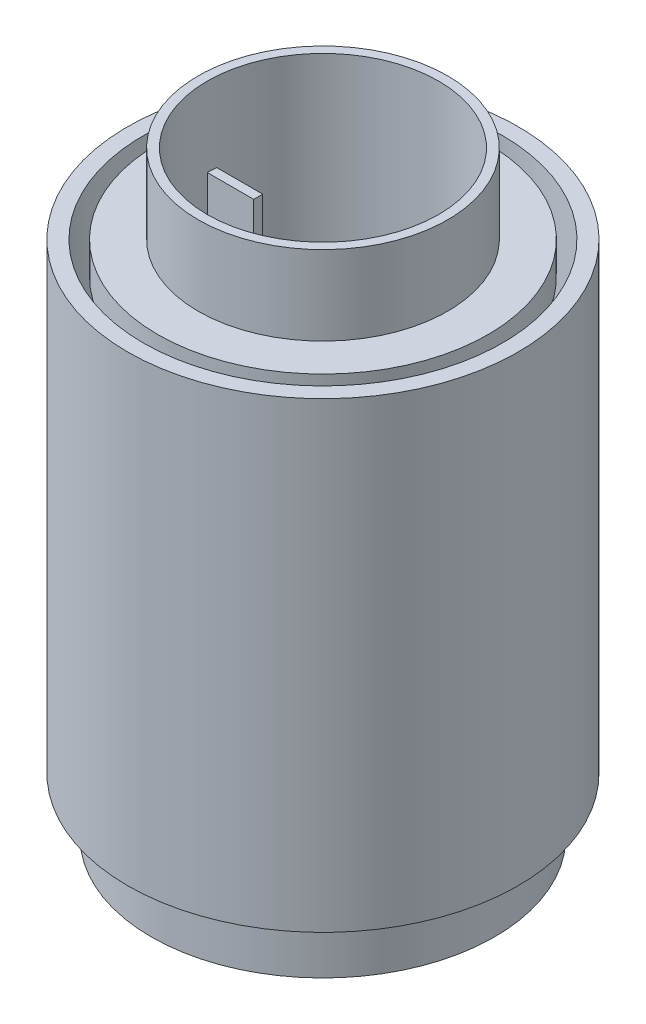
ISO-10303-21;
HEADER;
FILE_DESCRIPTION(('STEP AP214'),'2;1');
FILE_NAME('part.step','',(''),(''),'','','');
FILE_SCHEMA(('AUTOMOTIVE_DESIGN { 1 0 10303 214 1 1 1 1 }'));
ENDSEC;
DATA;
#1=APPLICATION_CONTEXT('core data for automotive mechanical design processes');
#2=APPLICATION_PROTOCOL_DEFINITION('international standard','automotive_design',2000,#1);
#3=PRODUCT_CONTEXT('',#1,'mechanical');
#4=PRODUCT('Part','Part','',(#3));
#5=PRODUCT_RELATED_PRODUCT_CATEGORY('part','',(#4));
#6=PRODUCT_DEFINITION_FORMATION('','',#4);
#7=PRODUCT_DEFINITION_CONTEXT('part definition',#1,'design');
#8=PRODUCT_DEFINITION('design','',#6,#7);
#9=PRODUCT_DEFINITION_SHAPE('','',#8);
#10=(LENGTH_UNIT() NAMED_UNIT(*) SI_UNIT(.MILLI.,.METRE.));
#11=(NAMED_UNIT(*) PLANE_ANGLE_UNIT() SI_UNIT($,.RADIAN.));
#12=(NAMED_UNIT(*) SI_UNIT($,.STERADIAN.) SOLID_ANGLE_UNIT());
#13=UNCERTAINTY_MEASURE_WITH_UNIT(LENGTH_MEASURE(1.E-05),#10,'distance_accuracy_value','');
#14=(GEOMETRIC_REPRESENTATION_CONTEXT(3) GLOBAL_UNCERTAINTY_ASSIGNED_CONTEXT((#13)) GLOBAL_UNIT_ASSIGNED_CONTEXT((#10,
#11,#12)) REPRESENTATION_CONTEXT('',''));
#15=CARTESIAN_POINT('',(0.,0.,0.));
#16=DIRECTION('',(0.,0.,1.));
#17=DIRECTION('',(1.,0.,0.));
#18=AXIS2_PLACEMENT_3D('',#15,#16,#17);
#19=CARTESIAN_POINT('',(0.,5.,0.));
#20=DIRECTION('',(0.,1.,0.));
#21=DIRECTION('',(0.,0.,1.));
#22=AXIS2_PLACEMENT_3D('',#19,#20,#21);
#23=PLANE('',#22);
#24=CARTESIAN_POINT('',(0.,5.,0.));
#25=DIRECTION('',(0.,1.,0.));
#26=DIRECTION('',(0.,0.,1.));
#27=AXIS2_PLACEMENT_3D('',#24,#25,#26);
#28=CIRCLE('',#27,29.5667950972865);
#29=CARTESIAN_POINT('',(0.,5.,29.5667950972865));
#30=VERTEX_POINT('',#29);
#31=EDGE_CURVE('E11',#30,#30,#28,.T.);
#32=ORIENTED_EDGE('',*,*,#31,.T.);
#33=EDGE_LOOP('',(#32));
#34=FACE_BOUND('',#33,.T.);
#35=CARTESIAN_POINT('',(0.,5.,0.));
#36=DIRECTION('',(0.,1.,0.));
#37=DIRECTION('',(0.,0.,1.));
#38=AXIS2_PLACEMENT_3D('',#35,#36,#37);
#39=CIRCLE('',#38,27.2032127719219);
#40=CARTESIAN_POINT('',(0.,5.,27.2032127719219));
#41=VERTEX_POINT('',#40);
#42=EDGE_CURVE('E57',#41,#41,#39,.T.);
#43=ORIENTED_EDGE('',*,*,#42,.F.);
#44=EDGE_LOOP('',(#43));
#45=FACE_BOUND('',#44,.T.);
#46=ADVANCED_FACE('F46',(#34,#45),#23,.T.);
#47=CARTESIAN_POINT('',(0.,-65.,0.));
#48=DIRECTION('',(0.,1.,0.));
#49=DIRECTION('',(0.,0.,1.));
#50=AXIS2_PLACEMENT_3D('',#47,#48,#49);
#51=PLANE('',#50);
#52=CARTESIAN_POINT('',(0.,-65.,0.));
#53=DIRECTION('',(0.,1.,0.));
#54=DIRECTION('',(0.,0.,1.));
#55=AXIS2_PLACEMENT_3D('',#52,#53,#54);
#56=CIRCLE('',#55,29.5667950972865);
#57=CARTESIAN_POINT('',(0.,-65.,29.5667950972865));
#58=VERTEX_POINT('',#57);
#59=EDGE_CURVE('E50',#58,#58,#56,.T.);
#60=ORIENTED_EDGE('',*,*,#59,.F.);
#61=EDGE_LOOP('',(#60));
#62=FACE_BOUND('',#61,.T.);
#63=CARTESIAN_POINT('',(0.,-65.,0.));
#64=DIRECTION('',(0.,1.,0.));
#65=DIRECTION('',(0.,0.,1.));
#66=AXIS2_PLACEMENT_3D('',#63,#64,#65);
#67=CIRCLE('',#66,27.2032127719219);
#68=CARTESIAN_POINT('',(0.,-65.,27.2032127719219));
#69=VERTEX_POINT('',#68);
#70=EDGE_CURVE('E59',#69,#69,#67,.T.);
#71=ORIENTED_EDGE('',*,*,#70,.T.);
#72=EDGE_LOOP('',(#71));
#73=FACE_BOUND('',#72,.T.);
#74=ADVANCED_FACE('F69',(#62,#73),#51,.F.);
#75=CARTESIAN_POINT('',(0.,5.,0.));
#76=DIRECTION('',(0.,-1.,0.));
#77=DIRECTION('',(0.,0.,-1.));
#78=AXIS2_PLACEMENT_3D('',#75,#76,#77);
#79=CYLINDRICAL_SURFACE('',#78,29.5667950972865);
#80=ORIENTED_EDGE('',*,*,#31,.F.);
#81=EDGE_LOOP('',(#80));
#82=FACE_BOUND('',#81,.T.);
#83=ORIENTED_EDGE('',*,*,#59,.T.);
#84=EDGE_LOOP('',(#83));
#85=FACE_BOUND('',#84,.T.);
#86=ADVANCED_FACE('F48',(#82,#85),#79,.T.);
#87=CARTESIAN_POINT('',(0.,5.,0.));
#88=DIRECTION('',(0.,-1.,0.));
#89=DIRECTION('',(0.,0.,-1.));
#90=AXIS2_PLACEMENT_3D('',#87,#88,#89);
#91=CYLINDRICAL_SURFACE('',#90,27.2032127719219);
#92=ORIENTED_EDGE('',*,*,#42,.T.);
#93=EDGE_LOOP('',(#92));
#94=FACE_BOUND('',#93,.T.);
#95=ORIENTED_EDGE('',*,*,#70,.F.);
#96=EDGE_LOOP('',(#95));
#97=FACE_BOUND('',#96,.T.);
#98=ADVANCED_FACE('F65',(#94,#97),#91,.F.);
#99=CLOSED_SHELL('',(#46,#74,#86,#98));
#100=MANIFOLD_SOLID_BREP('B2',#99);
#101=CARTESIAN_POINT('',(-17.4650572607484,5.,-1.36041410686601));
#102=DIRECTION('',(0.99924472436709,0.,0.0388584717216141));
#103=DIRECTION('',(0.0388584717216141,0.,-0.99924472436709));
#104=AXIS2_PLACEMENT_3D('',#101,#102,#103);
#105=PLANE('',#104);
#106=DIRECTION('',(-0.0388584717216141,0.,0.999244724367089));
#107=VECTOR('',#106,1.);
#108=CARTESIAN_POINT('',(-17.4650572607484,-65.,-1.36041410686601));
#109=LINE('',#108,#107);
#110=CARTESIAN_POINT('',(-17.4650572607484,-65.,-1.36041410686601));
#111=VERTEX_POINT('',#110);
#112=CARTESIAN_POINT('',(-17.5179608306269,-65.,0.));
#113=VERTEX_POINT('',#112);
#114=EDGE_CURVE('E181',#111,#113,#109,.T.);
#115=ORIENTED_EDGE('',*,*,#114,.T.);
#116=DIRECTION('',(0.,-1.,0.));
#117=VECTOR('',#116,1.);
#118=CARTESIAN_POINT('',(-17.5179608306269,5.,0.));
#119=LINE('',#118,#117);
#120=CARTESIAN_POINT('',(-17.5179608306269,5.,0.));
#121=VERTEX_POINT('',#120);
#122=EDGE_CURVE('E44',#121,#113,#119,.T.);
#123=ORIENTED_EDGE('',*,*,#122,.F.);
#124=DIRECTION('',(-0.0388584717216141,0.,0.999244724367089));
#125=VECTOR('',#124,1.);
#126=CARTESIAN_POINT('',(-17.4650572607484,5.,-1.36041410686601));
#127=LINE('',#126,#125);
#128=CARTESIAN_POINT('',(-17.4650572607484,5.,-1.36041410686601));
#129=VERTEX_POINT('',#128);
#130=EDGE_CURVE('E169',#129,#121,#127,.T.);
#131=ORIENTED_EDGE('',*,*,#130,.F.);
#132=DIRECTION('',(0.,-1.,0.));
#133=VECTOR('',#132,1.);
#134=CARTESIAN_POINT('',(-17.4650572607484,5.,-1.36041410686601));
#135=LINE('',#134,#133);
#136=EDGE_CURVE('E177',#129,#111,#135,.T.);
#137=ORIENTED_EDGE('',*,*,#136,.T.);
#138=EDGE_LOOP('',(#115,#123,#131,#137));
#139=FACE_BOUND('',#138,.T.);
#140=ADVANCED_FACE('F118',(#139),#105,.F.);
#141=CARTESIAN_POINT('',(-17.5179608306269,5.,0.));
#142=DIRECTION('',(0.,0.,-1.));
#143=DIRECTION('',(-1.,0.,0.));
#144=AXIS2_PLACEMENT_3D('',#141,#142,#143);
#145=PLANE('',#144);
#146=DIRECTION('',(1.,0.,0.));
#147=VECTOR('',#146,1.);
#148=CARTESIAN_POINT('',(-17.5179608306269,-65.,0.));
#149=LINE('',#148,#147);
#150=CARTESIAN_POINT('',(-10.4840818171956,-65.,0.));
#151=VERTEX_POINT('',#150);
#152=EDGE_CURVE('E173',#113,#151,#149,.T.);
#153=ORIENTED_EDGE('',*,*,#152,.T.);
#154=DIRECTION('',(0.,-1.,0.));
#155=VECTOR('',#154,1.);
#156=CARTESIAN_POINT('',(-10.4840818171956,5.,0.));
#157=LINE('',#156,#155);
#158=CARTESIAN_POINT('',(-10.4840818171956,5.,0.));
#159=VERTEX_POINT('',#158);
#160=EDGE_CURVE('E126',#159,#151,#157,.T.);
#161=ORIENTED_EDGE('',*,*,#160,.F.);
#162=DIRECTION('',(1.,0.,0.));
#163=VECTOR('',#162,1.);
#164=CARTESIAN_POINT('',(-17.5179608306269,5.,0.));
#165=LINE('',#164,#163);
#166=EDGE_CURVE('E164',#121,#159,#165,.T.);
#167=ORIENTED_EDGE('',*,*,#166,.F.);
#168=ORIENTED_EDGE('',*,*,#122,.T.);
#169=EDGE_LOOP('',(#153,#161,#167,#168));
#170=FACE_BOUND('',#169,.T.);
#171=ADVANCED_FACE('F172',(#170),#145,.F.);
#172=CARTESIAN_POINT('',(-10.4840818171956,5.,0.));
#173=DIRECTION('',(-1.,0.,0.));
#174=DIRECTION('',(0.,0.,1.));
#175=AXIS2_PLACEMENT_3D('',#172,#173,#174);
#176=PLANE('',#175);
#177=DIRECTION('',(0.,0.,-1.));
#178=VECTOR('',#177,1.);
#179=CARTESIAN_POINT('',(-10.4840818171956,-65.,0.));
#180=LINE('',#179,#178);
#181=CARTESIAN_POINT('',(-10.4840818171956,-65.,-1.36041410686601));
#182=VERTEX_POINT('',#181);
#183=EDGE_CURVE('E151',#151,#182,#180,.T.);
#184=ORIENTED_EDGE('',*,*,#183,.T.);
#185=DIRECTION('',(0.,-1.,0.));
#186=VECTOR('',#185,1.);
#187=CARTESIAN_POINT('',(-10.4840818171956,5.,-1.36041410686601));
#188=LINE('',#187,#186);
#189=CARTESIAN_POINT('',(-10.4840818171956,5.,-1.36041410686601));
#190=VERTEX_POINT('',#189);
#191=EDGE_CURVE('E174',#190,#182,#188,.T.);
#192=ORIENTED_EDGE('',*,*,#191,.F.);
#193=DIRECTION('',(0.,0.,-1.));
#194=VECTOR('',#193,1.);
#195=CARTESIAN_POINT('',(-10.4840818171956,5.,0.));
#196=LINE('',#195,#194);
#197=EDGE_CURVE('E167',#159,#190,#196,.T.);
#198=ORIENTED_EDGE('',*,*,#197,.F.);
#199=ORIENTED_EDGE('',*,*,#160,.T.);
#200=EDGE_LOOP('',(#184,#192,#198,#199));
#201=FACE_BOUND('',#200,.T.);
#202=ADVANCED_FACE('F175',(#201),#176,.F.);
#203=CARTESIAN_POINT('',(-10.4840818171956,5.,-1.36041410686601));
#204=DIRECTION('',(0.,0.,1.));
#205=DIRECTION('',(1.,0.,0.));
#206=AXIS2_PLACEMENT_3D('',#203,#204,#205);
#207=PLANE('',#206);
#208=DIRECTION('',(-1.,0.,0.));
#209=VECTOR('',#208,1.);
#210=CARTESIAN_POINT('',(-10.4840818171956,-65.,-1.36041410686601));
#211=LINE('',#210,#209);
#212=EDGE_CURVE('E157',#182,#111,#211,.T.);
#213=ORIENTED_EDGE('',*,*,#212,.T.);
#214=ORIENTED_EDGE('',*,*,#136,.F.);
#215=DIRECTION('',(-1.,0.,0.));
#216=VECTOR('',#215,1.);
#217=CARTESIAN_POINT('',(-10.4840818171956,5.,-1.36041410686601));
#218=LINE('',#217,#216);
#219=EDGE_CURVE('E134',#190,#129,#218,.T.);
#220=ORIENTED_EDGE('',*,*,#219,.F.);
#221=ORIENTED_EDGE('',*,*,#191,.T.);
#222=EDGE_LOOP('',(#213,#214,#220,#221));
#223=FACE_BOUND('',#222,.T.);
#224=ADVANCED_FACE('F188',(#223),#207,.F.);
#225=CARTESIAN_POINT('',(0.,5.00000000000003,0.));
#226=DIRECTION('',(0.,1.,0.));
#227=DIRECTION('',(0.,0.,1.));
#228=AXIS2_PLACEMENT_3D('',#225,#226,#227);
#229=PLANE('',#228);
#230=ORIENTED_EDGE('',*,*,#130,.T.);
#231=ORIENTED_EDGE('',*,*,#166,.T.);
#232=ORIENTED_EDGE('',*,*,#197,.T.);
#233=ORIENTED_EDGE('',*,*,#219,.T.);
#234=EDGE_LOOP('',(#230,#231,#232,#233));
#235=FACE_BOUND('',#234,.T.);
#236=ADVANCED_FACE('F165',(#235),#229,.T.);
#237=CARTESIAN_POINT('',(0.,-65.,0.));
#238=DIRECTION('',(0.,1.,0.));
#239=DIRECTION('',(0.,0.,1.));
#240=AXIS2_PLACEMENT_3D('',#237,#238,#239);
#241=PLANE('',#240);
#242=ORIENTED_EDGE('',*,*,#114,.F.);
#243=ORIENTED_EDGE('',*,*,#212,.F.);
#244=ORIENTED_EDGE('',*,*,#183,.F.);
#245=ORIENTED_EDGE('',*,*,#152,.F.);
#246=EDGE_LOOP('',(#242,#243,#244,#245));
#247=FACE_BOUND('',#246,.T.);
#248=ADVANCED_FACE('F191',(#247),#241,.F.);
#249=CLOSED_SHELL('',(#140,#171,#202,#224,#236,#248));
#250=MANIFOLD_SOLID_BREP('B6',#249);
#251=CARTESIAN_POINT('',(17.5179608306269,5.,0.));
#252=DIRECTION('',(-0.99924472436709,0.,0.0388584717216141));
#253=DIRECTION('',(0.0388584717216141,0.,0.99924472436709));
#254=AXIS2_PLACEMENT_3D('',#251,#252,#253);
#255=PLANE('',#254);
#256=DIRECTION('',(-0.0388584717216141,0.,-0.999244724367089));
#257=VECTOR('',#256,1.);
#258=CARTESIAN_POINT('',(17.5179608306269,-65.,0.));
#259=LINE('',#258,#257);
#260=CARTESIAN_POINT('',(17.5179608306269,-65.,0.));
#261=VERTEX_POINT('',#260);
#262=CARTESIAN_POINT('',(17.4650572607484,-65.,-1.36041410686601));
#263=VERTEX_POINT('',#262);
#264=EDGE_CURVE('E312',#261,#263,#259,.T.);
#265=ORIENTED_EDGE('',*,*,#264,.T.);
#266=DIRECTION('',(0.,-1.,0.));
#267=VECTOR('',#266,1.);
#268=CARTESIAN_POINT('',(17.4650572607484,5.,-1.36041410686601));
#269=LINE('',#268,#267);
#270=CARTESIAN_POINT('',(17.4650572607484,5.,-1.36041410686601));
#271=VERTEX_POINT('',#270);
#272=EDGE_CURVE('E116',#271,#263,#269,.T.);
#273=ORIENTED_EDGE('',*,*,#272,.F.);
#274=DIRECTION('',(-0.0388584717216141,0.,-0.999244724367089));
#275=VECTOR('',#274,1.);
#276=CARTESIAN_POINT('',(17.5179608306269,5.,0.));
#277=LINE('',#276,#275);
#278=CARTESIAN_POINT('',(17.5179608306269,5.,0.));
#279=VERTEX_POINT('',#278);
#280=EDGE_CURVE('E300',#279,#271,#277,.T.);
#281=ORIENTED_EDGE('',*,*,#280,.F.);
#282=DIRECTION('',(0.,-1.,0.));
#283=VECTOR('',#282,1.);
#284=CARTESIAN_POINT('',(17.5179608306269,5.,0.));
#285=LINE('',#284,#283);
#286=EDGE_CURVE('E308',#279,#261,#285,.T.);
#287=ORIENTED_EDGE('',*,*,#286,.T.);
#288=EDGE_LOOP('',(#265,#273,#281,#287));
#289=FACE_BOUND('',#288,.T.);
#290=ADVANCED_FACE('F249',(#289),#255,.F.);
#291=CARTESIAN_POINT('',(17.4650572607484,5.,-1.36041410686601));
#292=DIRECTION('',(0.,0.,1.));
#293=DIRECTION('',(1.,0.,0.));
#294=AXIS2_PLACEMENT_3D('',#291,#292,#293);
#295=PLANE('',#294);
#296=DIRECTION('',(-1.,0.,0.));
#297=VECTOR('',#296,1.);
#298=CARTESIAN_POINT('',(17.4650572607484,-65.,-1.36041410686601));
#299=LINE('',#298,#297);
#300=CARTESIAN_POINT('',(10.4840818171956,-65.,-1.36041410686601));
#301=VERTEX_POINT('',#300);
#302=EDGE_CURVE('E304',#263,#301,#299,.T.);
#303=ORIENTED_EDGE('',*,*,#302,.T.);
#304=DIRECTION('',(0.,-1.,0.));
#305=VECTOR('',#304,1.);
#306=CARTESIAN_POINT('',(10.4840818171956,5.,-1.36041410686601));
#307=LINE('',#306,#305);
#308=CARTESIAN_POINT('',(10.4840818171956,5.,-1.36041410686601));
#309=VERTEX_POINT('',#308);
#310=EDGE_CURVE('E257',#309,#301,#307,.T.);
#311=ORIENTED_EDGE('',*,*,#310,.F.);
#312=DIRECTION('',(-1.,0.,0.));
#313=VECTOR('',#312,1.);
#314=CARTESIAN_POINT('',(17.4650572607484,5.,-1.36041410686601));
#315=LINE('',#314,#313);
#316=EDGE_CURVE('E295',#271,#309,#315,.T.);
#317=ORIENTED_EDGE('',*,*,#316,.F.);
#318=ORIENTED_EDGE('',*,*,#272,.T.);
#319=EDGE_LOOP('',(#303,#311,#317,#318));
#320=FACE_BOUND('',#319,.T.);
#321=ADVANCED_FACE('F303',(#320),#295,.F.);
#322=CARTESIAN_POINT('',(10.4840818171956,5.,-1.36041410686601));
#323=DIRECTION('',(1.,0.,0.));
#324=DIRECTION('',(0.,0.,-1.));
#325=AXIS2_PLACEMENT_3D('',#322,#323,#324);
#326=PLANE('',#325);
#327=DIRECTION('',(0.,0.,1.));
#328=VECTOR('',#327,1.);
#329=CARTESIAN_POINT('',(10.4840818171956,-65.,-1.36041410686601));
#330=LINE('',#329,#328);
#331=CARTESIAN_POINT('',(10.4840818171956,-65.,0.));
#332=VERTEX_POINT('',#331);
#333=EDGE_CURVE('E282',#301,#332,#330,.T.);
#334=ORIENTED_EDGE('',*,*,#333,.T.);
#335=DIRECTION('',(0.,-1.,0.));
#336=VECTOR('',#335,1.);
#337=CARTESIAN_POINT('',(10.4840818171956,5.,0.));
#338=LINE('',#337,#336);
#339=CARTESIAN_POINT('',(10.4840818171956,5.,0.));
#340=VERTEX_POINT('',#339);
#341=EDGE_CURVE('E305',#340,#332,#338,.T.);
#342=ORIENTED_EDGE('',*,*,#341,.F.);
#343=DIRECTION('',(0.,0.,1.));
#344=VECTOR('',#343,1.);
#345=CARTESIAN_POINT('',(10.4840818171956,5.,-1.36041410686601));
#346=LINE('',#345,#344);
#347=EDGE_CURVE('E298',#309,#340,#346,.T.);
#348=ORIENTED_EDGE('',*,*,#347,.F.);
#349=ORIENTED_EDGE('',*,*,#310,.T.);
#350=EDGE_LOOP('',(#334,#342,#348,#349));
#351=FACE_BOUND('',#350,.T.);
#352=ADVANCED_FACE('F306',(#351),#326,.F.);
#353=CARTESIAN_POINT('',(10.4840818171956,5.,0.));
#354=DIRECTION('',(0.,0.,-1.));
#355=DIRECTION('',(-1.,0.,0.));
#356=AXIS2_PLACEMENT_3D('',#353,#354,#355);
#357=PLANE('',#356);
#358=DIRECTION('',(1.,0.,0.));
#359=VECTOR('',#358,1.);
#360=CARTESIAN_POINT('',(10.4840818171956,-65.,0.));
#361=LINE('',#360,#359);
#362=EDGE_CURVE('E288',#332,#261,#361,.T.);
#363=ORIENTED_EDGE('',*,*,#362,.T.);
#364=ORIENTED_EDGE('',*,*,#286,.F.);
#365=DIRECTION('',(1.,0.,0.));
#366=VECTOR('',#365,1.);
#367=CARTESIAN_POINT('',(10.4840818171956,5.,0.));
#368=LINE('',#367,#366);
#369=EDGE_CURVE('E265',#340,#279,#368,.T.);
#370=ORIENTED_EDGE('',*,*,#369,.F.);
#371=ORIENTED_EDGE('',*,*,#341,.T.);
#372=EDGE_LOOP('',(#363,#364,#370,#371));
#373=FACE_BOUND('',#372,.T.);
#374=ADVANCED_FACE('F319',(#373),#357,.F.);
#375=CARTESIAN_POINT('',(0.,5.00000000000003,0.));
#376=DIRECTION('',(0.,1.,0.));
#377=DIRECTION('',(0.,0.,1.));
#378=AXIS2_PLACEMENT_3D('',#375,#376,#377);
#379=PLANE('',#378);
#380=ORIENTED_EDGE('',*,*,#280,.T.);
#381=ORIENTED_EDGE('',*,*,#316,.T.);
#382=ORIENTED_EDGE('',*,*,#347,.T.);
#383=ORIENTED_EDGE('',*,*,#369,.T.);
#384=EDGE_LOOP('',(#380,#381,#382,#383));
#385=FACE_BOUND('',#384,.T.);
#386=ADVANCED_FACE('F296',(#385),#379,.T.);
#387=CARTESIAN_POINT('',(0.,-65.,0.));
#388=DIRECTION('',(0.,1.,0.));
#389=DIRECTION('',(0.,0.,1.));
#390=AXIS2_PLACEMENT_3D('',#387,#388,#389);
#391=PLANE('',#390);
#392=ORIENTED_EDGE('',*,*,#264,.F.);
#393=ORIENTED_EDGE('',*,*,#362,.F.);
#394=ORIENTED_EDGE('',*,*,#333,.F.);
#395=ORIENTED_EDGE('',*,*,#302,.F.);
#396=EDGE_LOOP('',(#392,#393,#394,#395));
#397=FACE_BOUND('',#396,.T.);
#398=ADVANCED_FACE('F322',(#397),#391,.F.);
#399=CLOSED_SHELL('',(#290,#321,#352,#374,#386,#398));
#400=MANIFOLD_SOLID_BREP('B38',#399);
#401=CARTESIAN_POINT('',(0.,5.,0.));
#402=DIRECTION('',(0.,1.,0.));
#403=DIRECTION('',(0.,0.,1.));
#404=AXIS2_PLACEMENT_3D('',#401,#402,#403);
#405=PLANE('',#404);
#406=CARTESIAN_POINT('',(0.,5.,0.));
#407=DIRECTION('',(0.,1.,0.));
#408=DIRECTION('',(0.,0.,1.));
#409=AXIS2_PLACEMENT_3D('',#406,#407,#408);
#410=CIRCLE('',#409,18.8886938742478);
#411=CARTESIAN_POINT('',(0.,5.,18.8886938742478));
#412=VERTEX_POINT('',#411);
#413=EDGE_CURVE('E392',#412,#412,#410,.T.);
#414=ORIENTED_EDGE('',*,*,#413,.F.);
#415=EDGE_LOOP('',(#414));
#416=FACE_BOUND('',#415,.T.);
#417=CARTESIAN_POINT('',(0.,5.,0.));
#418=DIRECTION('',(0.,1.,0.));
#419=DIRECTION('',(0.,0.,1.));
#420=AXIS2_PLACEMENT_3D('',#417,#418,#419);
#421=CIRCLE('',#420,25.);
#422=CARTESIAN_POINT('',(0.,5.,25.));
#423=VERTEX_POINT('',#422);
#424=EDGE_CURVE('E248',#423,#423,#421,.T.);
#425=ORIENTED_EDGE('',*,*,#424,.T.);
#426=EDGE_LOOP('',(#425));
#427=FACE_BOUND('',#426,.T.);
#428=ADVANCED_FACE('F373',(#416,#427),#405,.T.);
#429=CARTESIAN_POINT('',(0.,0.,0.));
#430=DIRECTION('',(0.,1.,0.));
#431=DIRECTION('',(0.,0.,1.));
#432=AXIS2_PLACEMENT_3D('',#429,#430,#431);
#433=PLANE('',#432);
#434=CARTESIAN_POINT('',(0.,0.,0.));
#435=DIRECTION('',(0.,1.,0.));
#436=DIRECTION('',(0.,0.,1.));
#437=AXIS2_PLACEMENT_3D('',#434,#435,#436);
#438=CIRCLE('',#437,25.);
#439=CARTESIAN_POINT('',(0.,0.,25.));
#440=VERTEX_POINT('',#439);
#441=EDGE_CURVE('E377',#440,#440,#438,.T.);
#442=ORIENTED_EDGE('',*,*,#441,.F.);
#443=EDGE_LOOP('',(#442));
#444=FACE_BOUND('',#443,.T.);
#445=CARTESIAN_POINT('',(0.,0.,0.));
#446=DIRECTION('',(0.,1.,0.));
#447=DIRECTION('',(0.,0.,1.));
#448=AXIS2_PLACEMENT_3D('',#445,#446,#447);
#449=CIRCLE('',#448,17.6775644490869);
#450=CARTESIAN_POINT('',(0.,0.,17.6775644490869));
#451=VERTEX_POINT('',#450);
#452=EDGE_CURVE('E384',#451,#451,#449,.T.);
#453=ORIENTED_EDGE('',*,*,#452,.T.);
#454=EDGE_LOOP('',(#453));
#455=FACE_BOUND('',#454,.T.);
#456=ADVANCED_FACE('F443',(#444,#455),#433,.F.);
#457=CARTESIAN_POINT('',(0.,5.,0.));
#458=DIRECTION('',(0.,-1.,0.));
#459=DIRECTION('',(0.,0.,-1.));
#460=AXIS2_PLACEMENT_3D('',#457,#458,#459);
#461=CYLINDRICAL_SURFACE('',#460,25.);
#462=ORIENTED_EDGE('',*,*,#424,.F.);
#463=EDGE_LOOP('',(#462));
#464=FACE_BOUND('',#463,.T.);
#465=ORIENTED_EDGE('',*,*,#441,.T.);
#466=EDGE_LOOP('',(#465));
#467=FACE_BOUND('',#466,.T.);
#468=ADVANCED_FACE('F375',(#464,#467),#461,.T.);
#469=CARTESIAN_POINT('',(0.,5.,0.));
#470=DIRECTION('',(0.,-1.,0.));
#471=DIRECTION('',(0.,0.,-1.));
#472=AXIS2_PLACEMENT_3D('',#469,#470,#471);
#473=CYLINDRICAL_SURFACE('',#472,17.6775644490869);
#474=CARTESIAN_POINT('',(0.,5.,0.));
#475=DIRECTION('',(0.,1.,0.));
#476=DIRECTION('',(0.,0.,1.));
#477=AXIS2_PLACEMENT_3D('',#474,#475,#476);
#478=CIRCLE('',#477,17.6775644490869);
#479=CARTESIAN_POINT('',(0.,5.,17.6775644490869));
#480=VERTEX_POINT('',#479);
#481=EDGE_CURVE('E388',#480,#480,#478,.T.);
#482=ORIENTED_EDGE('',*,*,#481,.T.);
#483=EDGE_LOOP('',(#482));
#484=FACE_BOUND('',#483,.T.);
#485=ORIENTED_EDGE('',*,*,#452,.F.);
#486=EDGE_LOOP('',(#485));
#487=FACE_BOUND('',#486,.T.);
#488=ADVANCED_FACE('F452',(#484,#487),#473,.F.);
#489=CARTESIAN_POINT('',(0.,5.,0.));
#490=DIRECTION('',(0.,1.,0.));
#491=DIRECTION('',(0.,0.,1.));
#492=AXIS2_PLACEMENT_3D('',#489,#490,#491);
#493=PLANE('',#492);
#494=CARTESIAN_POINT('',(0.,5.,0.));
#495=DIRECTION('',(0.,1.,0.));
#496=DIRECTION('',(0.,0.,1.));
#497=AXIS2_PLACEMENT_3D('',#494,#495,#496);
#498=CIRCLE('',#497,17.644324771484);
#499=CARTESIAN_POINT('',(0.,5.,17.644324771484));
#500=VERTEX_POINT('',#499);
#501=EDGE_CURVE('E400',#500,#500,#498,.T.);
#502=ORIENTED_EDGE('',*,*,#501,.T.);
#503=EDGE_LOOP('',(#502));
#504=FACE_BOUND('',#503,.T.);
#505=ORIENTED_EDGE('',*,*,#481,.F.);
#506=EDGE_LOOP('',(#505));
#507=FACE_BOUND('',#506,.T.);
#508=ADVANCED_FACE('F454',(#504,#507),#493,.F.);
#509=CARTESIAN_POINT('',(0.,17.,0.));
#510=DIRECTION('',(0.,1.,0.));
#511=DIRECTION('',(0.,0.,1.));
#512=AXIS2_PLACEMENT_3D('',#509,#510,#511);
#513=PLANE('',#512);
#514=CARTESIAN_POINT('',(0.,17.,0.));
#515=DIRECTION('',(0.,1.,0.));
#516=DIRECTION('',(0.,0.,1.));
#517=AXIS2_PLACEMENT_3D('',#514,#515,#516);
#518=CIRCLE('',#517,18.8886938742478);
#519=CARTESIAN_POINT('',(0.,17.,18.8886938742478));
#520=VERTEX_POINT('',#519);
#521=EDGE_CURVE('E391',#520,#520,#518,.T.);
#522=ORIENTED_EDGE('',*,*,#521,.T.);
#523=EDGE_LOOP('',(#522));
#524=FACE_BOUND('',#523,.T.);
#525=CARTESIAN_POINT('',(0.,17.,0.));
#526=DIRECTION('',(0.,1.,0.));
#527=DIRECTION('',(0.,0.,1.));
#528=AXIS2_PLACEMENT_3D('',#525,#526,#527);
#529=CIRCLE('',#528,17.5179608306269);
#530=CARTESIAN_POINT('',(0.,17.,17.5179608306269));
#531=VERTEX_POINT('',#530);
#532=EDGE_CURVE('E395',#531,#531,#529,.T.);
#533=ORIENTED_EDGE('',*,*,#532,.F.);
#534=EDGE_LOOP('',(#533));
#535=FACE_BOUND('',#534,.T.);
#536=ADVANCED_FACE('F438',(#524,#535),#513,.T.);
#537=CARTESIAN_POINT('',(0.,17.,0.));
#538=DIRECTION('',(0.,-1.,0.));
#539=DIRECTION('',(0.,0.,-1.));
#540=AXIS2_PLACEMENT_3D('',#537,#538,#539);
#541=CYLINDRICAL_SURFACE('',#540,18.8886938742478);
#542=ORIENTED_EDGE('',*,*,#521,.F.);
#543=EDGE_LOOP('',(#542));
#544=FACE_BOUND('',#543,.T.);
#545=ORIENTED_EDGE('',*,*,#413,.T.);
#546=EDGE_LOOP('',(#545));
#547=FACE_BOUND('',#546,.T.);
#548=ADVANCED_FACE('F428',(#544,#547),#541,.T.);
#549=CARTESIAN_POINT('',(0.,17.,0.));
#550=DIRECTION('',(0.,-1.,0.));
#551=DIRECTION('',(0.,0.,-1.));
#552=AXIS2_PLACEMENT_3D('',#549,#550,#551);
#553=CYLINDRICAL_SURFACE('',#552,17.5179608306269);
#554=ORIENTED_EDGE('',*,*,#532,.T.);
#555=EDGE_LOOP('',(#554));
#556=FACE_BOUND('',#555,.T.);
#557=CARTESIAN_POINT('',(0.,-74.,0.));
#558=DIRECTION('',(0.,1.,0.));
#559=DIRECTION('',(0.,0.,1.));
#560=AXIS2_PLACEMENT_3D('',#557,#558,#559);
#561=CIRCLE('',#560,17.5179608306269);
#562=CARTESIAN_POINT('',(0.,-74.,17.5179608306269));
#563=VERTEX_POINT('',#562);
#564=EDGE_CURVE('E418',#563,#563,#561,.T.);
#565=ORIENTED_EDGE('',*,*,#564,.F.);
#566=EDGE_LOOP('',(#565));
#567=FACE_BOUND('',#566,.T.);
#568=ADVANCED_FACE('F425',(#556,#567),#553,.F.);
#569=CARTESIAN_POINT('',(0.,-65.,0.));
#570=DIRECTION('',(0.,1.,0.));
#571=DIRECTION('',(0.,0.,1.));
#572=AXIS2_PLACEMENT_3D('',#569,#570,#571);
#573=CYLINDRICAL_SURFACE('',#572,17.644324771484);
#574=CARTESIAN_POINT('',(0.,-65.,0.));
#575=DIRECTION('',(0.,1.,0.));
#576=DIRECTION('',(0.,0.,1.));
#577=AXIS2_PLACEMENT_3D('',#574,#575,#576);
#578=CIRCLE('',#577,17.644324771484);
#579=CARTESIAN_POINT('',(0.,-65.,17.644324771484));
#580=VERTEX_POINT('',#579);
#581=EDGE_CURVE('E403',#580,#580,#578,.F.);
#582=ORIENTED_EDGE('',*,*,#581,.F.);
#583=EDGE_LOOP('',(#582));
#584=FACE_BOUND('',#583,.T.);
#585=ORIENTED_EDGE('',*,*,#501,.F.);
#586=EDGE_LOOP('',(#585));
#587=FACE_BOUND('',#586,.T.);
#588=ADVANCED_FACE('F427',(#584,#587),#573,.T.);
#589=CARTESIAN_POINT('',(0.,-73.5,0.));
#590=DIRECTION('',(0.,1.,0.));
#591=DIRECTION('',(0.,0.,1.));
#592=AXIS2_PLACEMENT_3D('',#589,#590,#591);
#593=CYLINDRICAL_SURFACE('',#592,26.);
#594=CARTESIAN_POINT('',(0.,-73.5,0.));
#595=DIRECTION('',(0.,1.,0.));
#596=DIRECTION('',(0.,0.,1.));
#597=AXIS2_PLACEMENT_3D('',#594,#595,#596);
#598=CIRCLE('',#597,26.);
#599=CARTESIAN_POINT('',(0.,-73.5,26.));
#600=VERTEX_POINT('',#599);
#601=EDGE_CURVE('E406',#600,#600,#598,.T.);
#602=ORIENTED_EDGE('',*,*,#601,.T.);
#603=EDGE_LOOP('',(#602));
#604=FACE_BOUND('',#603,.T.);
#605=CARTESIAN_POINT('',(0.,-65.,0.));
#606=DIRECTION('',(0.,1.,0.));
#607=DIRECTION('',(0.,0.,1.));
#608=AXIS2_PLACEMENT_3D('',#605,#606,#607);
#609=CIRCLE('',#608,26.);
#610=CARTESIAN_POINT('',(0.,-65.,26.));
#611=VERTEX_POINT('',#610);
#612=EDGE_CURVE('E407',#611,#611,#609,.T.);
#613=ORIENTED_EDGE('',*,*,#612,.F.);
#614=EDGE_LOOP('',(#613));
#615=FACE_BOUND('',#614,.T.);
#616=ADVANCED_FACE('F435',(#604,#615),#593,.T.);
#617=CARTESIAN_POINT('',(0.,-73.5,0.));
#618=DIRECTION('',(0.,1.,0.));
#619=DIRECTION('',(0.,0.,1.));
#620=AXIS2_PLACEMENT_3D('',#617,#618,#619);
#621=PLANE('',#620);
#622=CARTESIAN_POINT('',(0.,-73.5,0.));
#623=DIRECTION('',(0.,1.,0.));
#624=DIRECTION('',(0.,0.,1.));
#625=AXIS2_PLACEMENT_3D('',#622,#623,#624);
#626=CIRCLE('',#625,19.0275397146187);
#627=CARTESIAN_POINT('',(0.,-73.5,19.0275397146187));
#628=VERTEX_POINT('',#627);
#629=EDGE_CURVE('E410',#628,#628,#626,.T.);
#630=ORIENTED_EDGE('',*,*,#629,.T.);
#631=EDGE_LOOP('',(#630));
#632=FACE_BOUND('',#631,.T.);
#633=ORIENTED_EDGE('',*,*,#601,.F.);
#634=EDGE_LOOP('',(#633));
#635=FACE_BOUND('',#634,.T.);
#636=ADVANCED_FACE('F494',(#632,#635),#621,.F.);
#637=CARTESIAN_POINT('',(0.,-65.,0.));
#638=DIRECTION('',(0.,1.,0.));
#639=DIRECTION('',(0.,0.,1.));
#640=AXIS2_PLACEMENT_3D('',#637,#638,#639);
#641=PLANE('',#640);
#642=ORIENTED_EDGE('',*,*,#612,.T.);
#643=EDGE_LOOP('',(#642));
#644=FACE_BOUND('',#643,.T.);
#645=ORIENTED_EDGE('',*,*,#581,.T.);
#646=EDGE_LOOP('',(#645));
#647=FACE_BOUND('',#646,.T.);
#648=ADVANCED_FACE('F504',(#644,#647),#641,.T.);
#649=CARTESIAN_POINT('',(0.,-74.,0.));
#650=DIRECTION('',(0.,1.,0.));
#651=DIRECTION('',(0.,0.,1.));
#652=AXIS2_PLACEMENT_3D('',#649,#650,#651);
#653=CYLINDRICAL_SURFACE('',#652,19.0275397146187);
#654=CARTESIAN_POINT('',(0.,-74.,0.));
#655=DIRECTION('',(0.,1.,0.));
#656=DIRECTION('',(0.,0.,1.));
#657=AXIS2_PLACEMENT_3D('',#654,#655,#656);
#658=CIRCLE('',#657,19.0275397146187);
#659=CARTESIAN_POINT('',(0.,-74.,19.0275397146187));
#660=VERTEX_POINT('',#659);
#661=EDGE_CURVE('E415',#660,#660,#658,.T.);
#662=ORIENTED_EDGE('',*,*,#661,.T.);
#663=EDGE_LOOP('',(#662));
#664=FACE_BOUND('',#663,.T.);
#665=ORIENTED_EDGE('',*,*,#629,.F.);
#666=EDGE_LOOP('',(#665));
#667=FACE_BOUND('',#666,.T.);
#668=ADVANCED_FACE('F514',(#664,#667),#653,.T.);
#669=CARTESIAN_POINT('',(0.,-74.,0.));
#670=DIRECTION('',(0.,1.,0.));
#671=DIRECTION('',(0.,0.,1.));
#672=AXIS2_PLACEMENT_3D('',#669,#670,#671);
#673=PLANE('',#672);
#674=ORIENTED_EDGE('',*,*,#564,.T.);
#675=EDGE_LOOP('',(#674));
#676=FACE_BOUND('',#675,.T.);
#677=ORIENTED_EDGE('',*,*,#661,.F.);
#678=EDGE_LOOP('',(#677));
#679=FACE_BOUND('',#678,.T.);
#680=ADVANCED_FACE('F422',(#676,#679),#673,.F.);
#681=CLOSED_SHELL('',(#428,#456,#468,#488,#508,#536,#548,#568,#588,#616,#636,#648,#668,#680));
#682=MANIFOLD_SOLID_BREP('B110',#681);
#683=ADVANCED_BREP_SHAPE_REPRESENTATION('',(#18,#100,#250,#400,#682),#14);
#684=SHAPE_DEFINITION_REPRESENTATION(#9,#683);
ENDSEC;
END-ISO-10303-21;
